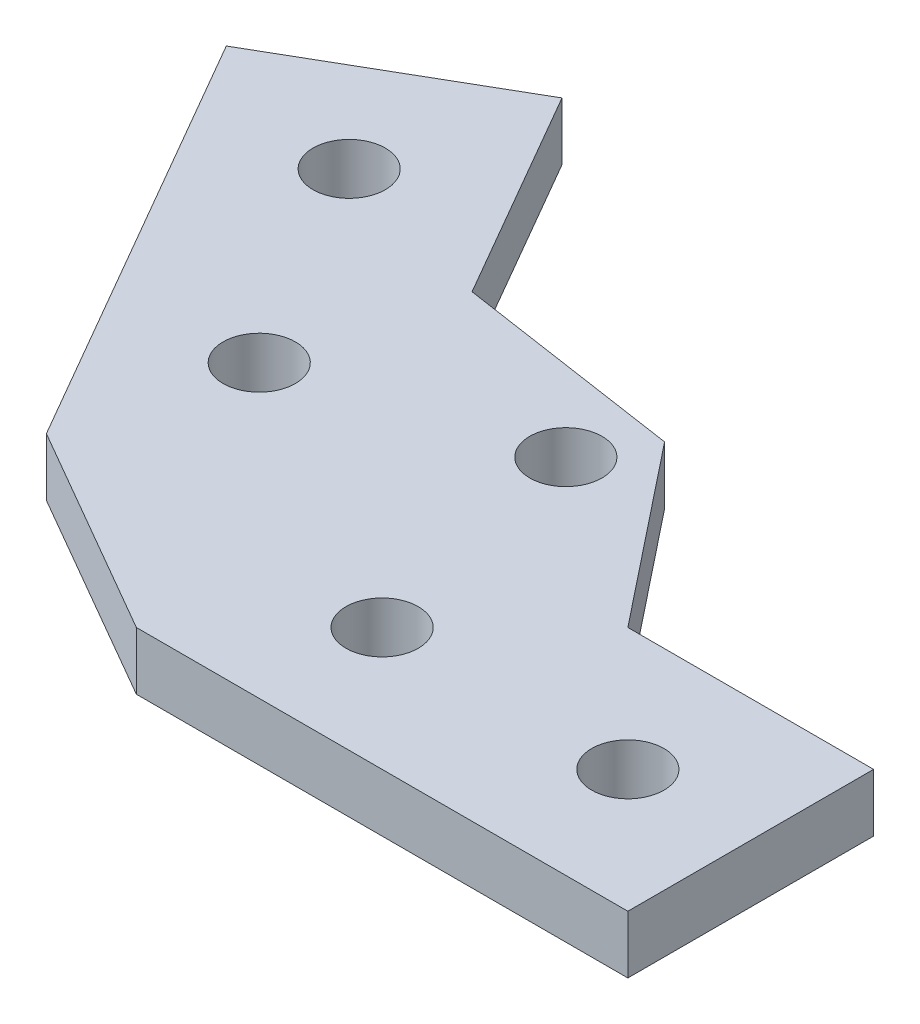
ISO-10303-21;
HEADER;
FILE_DESCRIPTION(('STEP AP214'),'2;1');
FILE_NAME('part.step','',(''),(''),'','','');
FILE_SCHEMA(('AUTOMOTIVE_DESIGN { 1 0 10303 214 1 1 1 1 }'));
ENDSEC;
DATA;
#1=APPLICATION_CONTEXT('core data for automotive mechanical design processes');
#2=APPLICATION_PROTOCOL_DEFINITION('international standard','automotive_design',2000,#1);
#3=PRODUCT_CONTEXT('',#1,'mechanical');
#4=PRODUCT('Part','Part','',(#3));
#5=PRODUCT_RELATED_PRODUCT_CATEGORY('part','',(#4));
#6=PRODUCT_DEFINITION_FORMATION('','',#4);
#7=PRODUCT_DEFINITION_CONTEXT('part definition',#1,'design');
#8=PRODUCT_DEFINITION('design','',#6,#7);
#9=PRODUCT_DEFINITION_SHAPE('','',#8);
#10=(LENGTH_UNIT() NAMED_UNIT(*) SI_UNIT(.MILLI.,.METRE.));
#11=(NAMED_UNIT(*) PLANE_ANGLE_UNIT() SI_UNIT($,.RADIAN.));
#12=(NAMED_UNIT(*) SI_UNIT($,.STERADIAN.) SOLID_ANGLE_UNIT());
#13=UNCERTAINTY_MEASURE_WITH_UNIT(LENGTH_MEASURE(1.E-05),#10,'distance_accuracy_value','');
#14=(GEOMETRIC_REPRESENTATION_CONTEXT(3) GLOBAL_UNCERTAINTY_ASSIGNED_CONTEXT((#13)) GLOBAL_UNIT_ASSIGNED_CONTEXT((#10,
#11,#12)) REPRESENTATION_CONTEXT('',''));
#15=CARTESIAN_POINT('',(0.,0.,0.));
#16=DIRECTION('',(0.,0.,1.));
#17=DIRECTION('',(1.,0.,0.));
#18=AXIS2_PLACEMENT_3D('',#15,#16,#17);
#19=CARTESIAN_POINT('',(0.,4.,0.));
#20=DIRECTION('',(0.,0.,1.));
#21=DIRECTION('',(1.,0.,0.));
#22=AXIS2_PLACEMENT_3D('',#19,#20,#21);
#23=PLANE('',#22);
#24=DIRECTION('',(0.,-1.,0.));
#25=VECTOR('',#24,1.);
#26=CARTESIAN_POINT('',(17.,4.,0.));
#27=LINE('',#26,#25);
#28=CARTESIAN_POINT('',(17.,4.,0.));
#29=VERTEX_POINT('',#28);
#30=CARTESIAN_POINT('',(17.,0.,0.));
#31=VERTEX_POINT('',#30);
#32=EDGE_CURVE('E56',#29,#31,#27,.T.);
#33=ORIENTED_EDGE('',*,*,#32,.F.);
#34=DIRECTION('',(-1.,0.,0.));
#35=VECTOR('',#34,1.);
#36=CARTESIAN_POINT('',(0.,4.,0.));
#37=LINE('',#36,#35);
#38=CARTESIAN_POINT('',(34.,4.,0.));
#39=VERTEX_POINT('',#38);
#40=EDGE_CURVE('E121',#39,#29,#37,.T.);
#41=ORIENTED_EDGE('',*,*,#40,.F.);
#42=DIRECTION('',(0.,-1.,0.));
#43=VECTOR('',#42,1.);
#44=CARTESIAN_POINT('',(34.,4.,0.));
#45=LINE('',#44,#43);
#46=CARTESIAN_POINT('',(34.,0.,0.));
#47=VERTEX_POINT('',#46);
#48=EDGE_CURVE('E203',#39,#47,#45,.T.);
#49=ORIENTED_EDGE('',*,*,#48,.T.);
#50=DIRECTION('',(-1.,0.,0.));
#51=VECTOR('',#50,1.);
#52=CARTESIAN_POINT('',(0.,0.,0.));
#53=LINE('',#52,#51);
#54=EDGE_CURVE('E61',#47,#31,#53,.T.);
#55=ORIENTED_EDGE('',*,*,#54,.T.);
#56=EDGE_LOOP('',(#33,#41,#49,#55));
#57=FACE_BOUND('',#56,.T.);
#58=ADVANCED_FACE('F41',(#57),#23,.F.);
#59=CARTESIAN_POINT('',(0.,4.,0.));
#60=DIRECTION('',(-0.866025403784436,0.,0.500000000000005));
#61=DIRECTION('',(-0.500000000000004,0.,-0.866025403784436));
#62=AXIS2_PLACEMENT_3D('',#59,#60,#61);
#63=PLANE('',#62);
#64=DIRECTION('',(0.,-1.,0.));
#65=VECTOR('',#64,1.);
#66=CARTESIAN_POINT('',(-8.50000000000015,4.,-14.7224318643354));
#67=LINE('',#66,#65);
#68=CARTESIAN_POINT('',(-8.50000000000015,4.,-14.7224318643354));
#69=VERTEX_POINT('',#68);
#70=CARTESIAN_POINT('',(-8.50000000000004,0.,-14.7224318643354));
#71=VERTEX_POINT('',#70);
#72=EDGE_CURVE('E132',#69,#71,#67,.T.);
#73=ORIENTED_EDGE('',*,*,#72,.T.);
#74=DIRECTION('',(0.500000000000004,0.,0.866025403784436));
#75=VECTOR('',#74,1.);
#76=CARTESIAN_POINT('',(0.,0.,0.));
#77=LINE('',#76,#75);
#78=CARTESIAN_POINT('',(-17.0000000000001,0.,-29.4448637286708));
#79=VERTEX_POINT('',#78);
#80=EDGE_CURVE('E160',#79,#71,#77,.T.);
#81=ORIENTED_EDGE('',*,*,#80,.F.);
#82=DIRECTION('',(0.,-1.,0.));
#83=VECTOR('',#82,1.);
#84=CARTESIAN_POINT('',(-17.0000000000001,4.,-29.4448637286708));
#85=LINE('',#84,#83);
#86=CARTESIAN_POINT('',(-17.0000000000001,4.,-29.4448637286708));
#87=VERTEX_POINT('',#86);
#88=EDGE_CURVE('E165',#87,#79,#85,.T.);
#89=ORIENTED_EDGE('',*,*,#88,.F.);
#90=DIRECTION('',(0.500000000000004,0.,0.866025403784436));
#91=VECTOR('',#90,1.);
#92=CARTESIAN_POINT('',(0.,4.,0.));
#93=LINE('',#92,#91);
#94=EDGE_CURVE('E163',#87,#69,#93,.T.);
#95=ORIENTED_EDGE('',*,*,#94,.T.);
#96=EDGE_LOOP('',(#73,#81,#89,#95));
#97=FACE_BOUND('',#96,.T.);
#98=ADVANCED_FACE('F222',(#97),#63,.F.);
#99=CARTESIAN_POINT('',(0.,4.,0.));
#100=DIRECTION('',(0.,1.,0.));
#101=DIRECTION('',(0.,0.,1.));
#102=AXIS2_PLACEMENT_3D('',#99,#100,#101);
#103=PLANE('',#102);
#104=ORIENTED_EDGE('',*,*,#40,.T.);
#105=DIRECTION('',(-0.62222130585111,0.,-0.782841392968549));
#106=VECTOR('',#105,1.);
#107=CARTESIAN_POINT('',(7.15284724790802,4.,-12.389094852156));
#108=LINE('',#107,#106);
#109=CARTESIAN_POINT('',(7.15284724790802,4.,-12.389094852156));
#110=VERTEX_POINT('',#109);
#111=EDGE_CURVE('E113',#29,#110,#108,.T.);
#112=ORIENTED_EDGE('',*,*,#111,.T.);
#113=DIRECTION('',(-0.989071186370317,0.,-0.147438761158706));
#114=VECTOR('',#113,1.);
#115=CARTESIAN_POINT('',(7.15284724790802,4.,-12.389094852156));
#116=LINE('',#115,#114);
#117=EDGE_CURVE('E119',#110,#69,#116,.T.);
#118=ORIENTED_EDGE('',*,*,#117,.T.);
#119=ORIENTED_EDGE('',*,*,#94,.F.);
#120=DIRECTION('',(0.866025403784436,0.,-0.500000000000005));
#121=VECTOR('',#120,1.);
#122=CARTESIAN_POINT('',(-17.0000000000001,4.,-29.4448637286708));
#123=LINE('',#122,#121);
#124=CARTESIAN_POINT('',(-31.7224318643356,4.,-20.9448637286708));
#125=VERTEX_POINT('',#124);
#126=EDGE_CURVE('E159',#125,#87,#123,.T.);
#127=ORIENTED_EDGE('',*,*,#126,.F.);
#128=DIRECTION('',(-0.500000000000004,0.,-0.866025403784436));
#129=VECTOR('',#128,1.);
#130=CARTESIAN_POINT('',(-14.7224318643354,4.,8.50000000000008));
#131=LINE('',#130,#129);
#132=CARTESIAN_POINT('',(-14.7224318643354,4.,8.50000000000008));
#133=VERTEX_POINT('',#132);
#134=EDGE_CURVE('E156',#133,#125,#131,.T.);
#135=ORIENTED_EDGE('',*,*,#134,.F.);
#136=DIRECTION('',(0.86602540378444,0.,0.499999999999998));
#137=VECTOR('',#136,1.);
#138=CARTESIAN_POINT('',(-14.7224318643354,4.,8.50000000000008));
#139=LINE('',#138,#137);
#140=CARTESIAN_POINT('',(0.,4.,17.));
#141=VERTEX_POINT('',#140);
#142=EDGE_CURVE('E177',#133,#141,#139,.T.);
#143=ORIENTED_EDGE('',*,*,#142,.T.);
#144=DIRECTION('',(1.,0.,0.));
#145=VECTOR('',#144,1.);
#146=CARTESIAN_POINT('',(0.,4.,17.));
#147=LINE('',#146,#145);
#148=CARTESIAN_POINT('',(34.,4.,17.));
#149=VERTEX_POINT('',#148);
#150=EDGE_CURVE('E198',#141,#149,#147,.T.);
#151=ORIENTED_EDGE('',*,*,#150,.T.);
#152=DIRECTION('',(0.,0.,-1.));
#153=VECTOR('',#152,1.);
#154=CARTESIAN_POINT('',(34.,4.,0.));
#155=LINE('',#154,#153);
#156=EDGE_CURVE('E200',#149,#39,#155,.T.);
#157=ORIENTED_EDGE('',*,*,#156,.T.);
#158=EDGE_LOOP('',(#104,#112,#118,#119,#127,#135,#143,#151,#157));
#159=FACE_BOUND('',#158,.T.);
#160=CARTESIAN_POINT('',(8.5,4.,8.5));
#161=DIRECTION('',(0.,1.,0.));
#162=DIRECTION('',(0.,0.,1.));
#163=AXIS2_PLACEMENT_3D('',#160,#161,#162);
#164=CIRCLE('',#163,2.5);
#165=CARTESIAN_POINT('',(8.5,4.,11.));
#166=VERTEX_POINT('',#165);
#167=EDGE_CURVE('E192',#166,#166,#164,.T.);
#168=ORIENTED_EDGE('',*,*,#167,.F.);
#169=EDGE_LOOP('',(#168));
#170=FACE_BOUND('',#169,.T.);
#171=CARTESIAN_POINT('',(25.5,4.,8.5));
#172=DIRECTION('',(0.,1.,0.));
#173=DIRECTION('',(0.,0.,1.));
#174=AXIS2_PLACEMENT_3D('',#171,#172,#173);
#175=CIRCLE('',#174,2.5);
#176=CARTESIAN_POINT('',(25.5,4.,11.));
#177=VERTEX_POINT('',#176);
#178=EDGE_CURVE('E186',#177,#177,#175,.T.);
#179=ORIENTED_EDGE('',*,*,#178,.F.);
#180=EDGE_LOOP('',(#179));
#181=FACE_BOUND('',#180,.T.);
#182=CARTESIAN_POINT('',(-11.6112159321677,4.,-3.11121593216767));
#183=DIRECTION('',(0.,-1.,0.));
#184=DIRECTION('',(-0.866025403784436,0.,0.500000000000005));
#185=AXIS2_PLACEMENT_3D('',#182,#183,#184);
#186=CIRCLE('',#185,2.5);
#187=CARTESIAN_POINT('',(-13.7762794416288,4.,-1.86121593216766));
#188=VERTEX_POINT('',#187);
#189=EDGE_CURVE('E150',#188,#188,#186,.T.);
#190=ORIENTED_EDGE('',*,*,#189,.T.);
#191=EDGE_LOOP('',(#190));
#192=FACE_BOUND('',#191,.T.);
#193=CARTESIAN_POINT('',(-20.1112159321678,4.,-17.8336477965031));
#194=DIRECTION('',(0.,-1.,0.));
#195=DIRECTION('',(-0.866025403784436,0.,0.500000000000005));
#196=AXIS2_PLACEMENT_3D('',#193,#194,#195);
#197=CIRCLE('',#196,2.5);
#198=CARTESIAN_POINT('',(-22.2762794416289,4.,-16.5836477965031));
#199=VERTEX_POINT('',#198);
#200=EDGE_CURVE('E144',#199,#199,#197,.T.);
#201=ORIENTED_EDGE('',*,*,#200,.T.);
#202=EDGE_LOOP('',(#201));
#203=FACE_BOUND('',#202,.T.);
#204=CARTESIAN_POINT('',(4.65284724790803,4.,-8.05896783323379));
#205=DIRECTION('',(0.,1.,0.));
#206=DIRECTION('',(0.,0.,1.));
#207=AXIS2_PLACEMENT_3D('',#204,#205,#206);
#208=CIRCLE('',#207,2.5);
#209=CARTESIAN_POINT('',(4.65284724790803,4.,-5.55896783323379));
#210=VERTEX_POINT('',#209);
#211=EDGE_CURVE('E140',#210,#210,#208,.T.);
#212=ORIENTED_EDGE('',*,*,#211,.F.);
#213=EDGE_LOOP('',(#212));
#214=FACE_BOUND('',#213,.T.);
#215=ADVANCED_FACE('F115',(#159,#170,#181,#192,#203,#214),#103,.T.);
#216=CARTESIAN_POINT('',(0.,0.,0.));
#217=DIRECTION('',(0.,1.,0.));
#218=DIRECTION('',(0.,0.,1.));
#219=AXIS2_PLACEMENT_3D('',#216,#217,#218);
#220=PLANE('',#219);
#221=DIRECTION('',(-0.62222130585111,0.,-0.782841392968549));
#222=VECTOR('',#221,1.);
#223=CARTESIAN_POINT('',(7.15284724790802,0.,-12.389094852156));
#224=LINE('',#223,#222);
#225=CARTESIAN_POINT('',(7.15284724790802,0.,-12.389094852156));
#226=VERTEX_POINT('',#225);
#227=EDGE_CURVE('E128',#31,#226,#224,.T.);
#228=ORIENTED_EDGE('',*,*,#227,.F.);
#229=ORIENTED_EDGE('',*,*,#54,.F.);
#230=DIRECTION('',(0.,0.,-1.));
#231=VECTOR('',#230,1.);
#232=CARTESIAN_POINT('',(34.,0.,0.));
#233=LINE('',#232,#231);
#234=CARTESIAN_POINT('',(34.,0.,17.));
#235=VERTEX_POINT('',#234);
#236=EDGE_CURVE('E205',#235,#47,#233,.T.);
#237=ORIENTED_EDGE('',*,*,#236,.F.);
#238=DIRECTION('',(1.,0.,0.));
#239=VECTOR('',#238,1.);
#240=CARTESIAN_POINT('',(0.,0.,17.));
#241=LINE('',#240,#239);
#242=CARTESIAN_POINT('',(0.,0.,17.));
#243=VERTEX_POINT('',#242);
#244=EDGE_CURVE('E195',#243,#235,#241,.T.);
#245=ORIENTED_EDGE('',*,*,#244,.F.);
#246=DIRECTION('',(0.86602540378444,0.,0.499999999999998));
#247=VECTOR('',#246,1.);
#248=CARTESIAN_POINT('',(-14.7224318643354,0.,8.50000000000008));
#249=LINE('',#248,#247);
#250=CARTESIAN_POINT('',(-14.7224318643354,0.,8.50000000000008));
#251=VERTEX_POINT('',#250);
#252=EDGE_CURVE('E176',#251,#243,#249,.T.);
#253=ORIENTED_EDGE('',*,*,#252,.F.);
#254=DIRECTION('',(-0.500000000000004,0.,-0.866025403784436));
#255=VECTOR('',#254,1.);
#256=CARTESIAN_POINT('',(-14.7224318643354,0.,8.50000000000008));
#257=LINE('',#256,#255);
#258=CARTESIAN_POINT('',(-31.7224318643356,0.,-20.9448637286708));
#259=VERTEX_POINT('',#258);
#260=EDGE_CURVE('E153',#251,#259,#257,.T.);
#261=ORIENTED_EDGE('',*,*,#260,.T.);
#262=DIRECTION('',(0.866025403784436,0.,-0.500000000000005));
#263=VECTOR('',#262,1.);
#264=CARTESIAN_POINT('',(-17.0000000000001,0.,-29.4448637286708));
#265=LINE('',#264,#263);
#266=EDGE_CURVE('E168',#259,#79,#265,.T.);
#267=ORIENTED_EDGE('',*,*,#266,.T.);
#268=ORIENTED_EDGE('',*,*,#80,.T.);
#269=DIRECTION('',(-0.989071186370317,0.,-0.147438761158706));
#270=VECTOR('',#269,1.);
#271=CARTESIAN_POINT('',(7.15284724790802,0.,-12.389094852156));
#272=LINE('',#271,#270);
#273=EDGE_CURVE('E123',#226,#71,#272,.T.);
#274=ORIENTED_EDGE('',*,*,#273,.F.);
#275=EDGE_LOOP('',(#228,#229,#237,#245,#253,#261,#267,#268,#274));
#276=FACE_BOUND('',#275,.T.);
#277=CARTESIAN_POINT('',(8.5,0.,8.5));
#278=DIRECTION('',(0.,1.,0.));
#279=DIRECTION('',(0.,0.,1.));
#280=AXIS2_PLACEMENT_3D('',#277,#278,#279);
#281=CIRCLE('',#280,2.5);
#282=CARTESIAN_POINT('',(8.5,0.,11.));
#283=VERTEX_POINT('',#282);
#284=EDGE_CURVE('E189',#283,#283,#281,.T.);
#285=ORIENTED_EDGE('',*,*,#284,.T.);
#286=EDGE_LOOP('',(#285));
#287=FACE_BOUND('',#286,.T.);
#288=CARTESIAN_POINT('',(25.5,0.,8.5));
#289=DIRECTION('',(0.,1.,0.));
#290=DIRECTION('',(0.,0.,1.));
#291=AXIS2_PLACEMENT_3D('',#288,#289,#290);
#292=CIRCLE('',#291,2.5);
#293=CARTESIAN_POINT('',(25.5,0.,11.));
#294=VERTEX_POINT('',#293);
#295=EDGE_CURVE('E185',#294,#294,#292,.T.);
#296=ORIENTED_EDGE('',*,*,#295,.T.);
#297=EDGE_LOOP('',(#296));
#298=FACE_BOUND('',#297,.T.);
#299=CARTESIAN_POINT('',(-11.6112159321677,0.,-3.11121593216767));
#300=DIRECTION('',(0.,-1.,0.));
#301=DIRECTION('',(-0.866025403784436,0.,0.500000000000005));
#302=AXIS2_PLACEMENT_3D('',#299,#300,#301);
#303=CIRCLE('',#302,2.5);
#304=CARTESIAN_POINT('',(-13.7762794416288,0.,-1.86121593216766));
#305=VERTEX_POINT('',#304);
#306=EDGE_CURVE('E147',#305,#305,#303,.T.);
#307=ORIENTED_EDGE('',*,*,#306,.F.);
#308=EDGE_LOOP('',(#307));
#309=FACE_BOUND('',#308,.T.);
#310=CARTESIAN_POINT('',(-20.1112159321678,0.,-17.8336477965031));
#311=DIRECTION('',(0.,-1.,0.));
#312=DIRECTION('',(-0.866025403784436,0.,0.500000000000005));
#313=AXIS2_PLACEMENT_3D('',#310,#311,#312);
#314=CIRCLE('',#313,2.5);
#315=CARTESIAN_POINT('',(-22.2762794416289,0.,-16.5836477965031));
#316=VERTEX_POINT('',#315);
#317=EDGE_CURVE('E143',#316,#316,#314,.T.);
#318=ORIENTED_EDGE('',*,*,#317,.F.);
#319=EDGE_LOOP('',(#318));
#320=FACE_BOUND('',#319,.T.);
#321=CARTESIAN_POINT('',(4.65284724790803,0.,-8.05896783323379));
#322=DIRECTION('',(0.,1.,0.));
#323=DIRECTION('',(0.,0.,1.));
#324=AXIS2_PLACEMENT_3D('',#321,#322,#323);
#325=CIRCLE('',#324,2.5);
#326=CARTESIAN_POINT('',(4.65284724790803,0.,-5.55896783323379));
#327=VERTEX_POINT('',#326);
#328=EDGE_CURVE('E285',#327,#327,#325,.T.);
#329=ORIENTED_EDGE('',*,*,#328,.T.);
#330=EDGE_LOOP('',(#329));
#331=FACE_BOUND('',#330,.T.);
#332=ADVANCED_FACE('F217',(#276,#287,#298,#309,#320,#331),#220,.F.);
#333=CARTESIAN_POINT('',(0.,4.,17.));
#334=DIRECTION('',(0.,0.,-1.));
#335=DIRECTION('',(-1.,0.,0.));
#336=AXIS2_PLACEMENT_3D('',#333,#334,#335);
#337=PLANE('',#336);
#338=ORIENTED_EDGE('',*,*,#244,.T.);
#339=DIRECTION('',(0.,-1.,0.));
#340=VECTOR('',#339,1.);
#341=CARTESIAN_POINT('',(34.,4.,17.));
#342=LINE('',#341,#340);
#343=EDGE_CURVE('E49',#149,#235,#342,.T.);
#344=ORIENTED_EDGE('',*,*,#343,.F.);
#345=ORIENTED_EDGE('',*,*,#150,.F.);
#346=DIRECTION('',(0.,-1.,0.));
#347=VECTOR('',#346,1.);
#348=CARTESIAN_POINT('',(0.,4.,17.));
#349=LINE('',#348,#347);
#350=EDGE_CURVE('E11',#141,#243,#349,.T.);
#351=ORIENTED_EDGE('',*,*,#350,.T.);
#352=EDGE_LOOP('',(#338,#344,#345,#351));
#353=FACE_BOUND('',#352,.T.);
#354=ADVANCED_FACE('F43',(#353),#337,.F.);
#355=CARTESIAN_POINT('',(34.,4.,0.));
#356=DIRECTION('',(-1.,0.,0.));
#357=DIRECTION('',(0.,0.,1.));
#358=AXIS2_PLACEMENT_3D('',#355,#356,#357);
#359=PLANE('',#358);
#360=ORIENTED_EDGE('',*,*,#236,.T.);
#361=ORIENTED_EDGE('',*,*,#48,.F.);
#362=ORIENTED_EDGE('',*,*,#156,.F.);
#363=ORIENTED_EDGE('',*,*,#343,.T.);
#364=EDGE_LOOP('',(#360,#361,#362,#363));
#365=FACE_BOUND('',#364,.T.);
#366=ADVANCED_FACE('F213',(#365),#359,.F.);
#367=CARTESIAN_POINT('',(8.5,4.,8.5));
#368=DIRECTION('',(0.,-1.,0.));
#369=DIRECTION('',(0.,0.,-1.));
#370=AXIS2_PLACEMENT_3D('',#367,#368,#369);
#371=CYLINDRICAL_SURFACE('',#370,2.5);
#372=ORIENTED_EDGE('',*,*,#167,.T.);
#373=EDGE_LOOP('',(#372));
#374=FACE_BOUND('',#373,.T.);
#375=ORIENTED_EDGE('',*,*,#284,.F.);
#376=EDGE_LOOP('',(#375));
#377=FACE_BOUND('',#376,.T.);
#378=ADVANCED_FACE('F240',(#374,#377),#371,.F.);
#379=CARTESIAN_POINT('',(25.5,4.,8.5));
#380=DIRECTION('',(0.,-1.,0.));
#381=DIRECTION('',(0.,0.,-1.));
#382=AXIS2_PLACEMENT_3D('',#379,#380,#381);
#383=CYLINDRICAL_SURFACE('',#382,2.5);
#384=ORIENTED_EDGE('',*,*,#178,.T.);
#385=EDGE_LOOP('',(#384));
#386=FACE_BOUND('',#385,.T.);
#387=ORIENTED_EDGE('',*,*,#295,.F.);
#388=EDGE_LOOP('',(#387));
#389=FACE_BOUND('',#388,.T.);
#390=ADVANCED_FACE('F255',(#386,#389),#383,.F.);
#391=CARTESIAN_POINT('',(-14.7224318643354,4.,8.50000000000008));
#392=DIRECTION('',(0.499999999999998,0.,-0.86602540378444));
#393=DIRECTION('',(-0.86602540378444,0.,-0.499999999999998));
#394=AXIS2_PLACEMENT_3D('',#391,#392,#393);
#395=PLANE('',#394);
#396=ORIENTED_EDGE('',*,*,#252,.T.);
#397=ORIENTED_EDGE('',*,*,#350,.F.);
#398=ORIENTED_EDGE('',*,*,#142,.F.);
#399=DIRECTION('',(0.,-1.,0.));
#400=VECTOR('',#399,1.);
#401=CARTESIAN_POINT('',(-14.7224318643354,4.,8.50000000000008));
#402=LINE('',#401,#400);
#403=EDGE_CURVE('E180',#133,#251,#402,.T.);
#404=ORIENTED_EDGE('',*,*,#403,.T.);
#405=EDGE_LOOP('',(#396,#397,#398,#404));
#406=FACE_BOUND('',#405,.T.);
#407=ADVANCED_FACE('F232',(#406),#395,.F.);
#408=CARTESIAN_POINT('',(-14.7224318643354,4.,8.50000000000008));
#409=DIRECTION('',(0.866025403784436,0.,-0.500000000000005));
#410=DIRECTION('',(0.500000000000004,0.,0.866025403784436));
#411=AXIS2_PLACEMENT_3D('',#408,#409,#410);
#412=PLANE('',#411);
#413=ORIENTED_EDGE('',*,*,#260,.F.);
#414=ORIENTED_EDGE('',*,*,#403,.F.);
#415=ORIENTED_EDGE('',*,*,#134,.T.);
#416=DIRECTION('',(0.,-1.,0.));
#417=VECTOR('',#416,1.);
#418=CARTESIAN_POINT('',(-31.7224318643356,4.,-20.9448637286708));
#419=LINE('',#418,#417);
#420=EDGE_CURVE('E174',#125,#259,#419,.T.);
#421=ORIENTED_EDGE('',*,*,#420,.T.);
#422=EDGE_LOOP('',(#413,#414,#415,#421));
#423=FACE_BOUND('',#422,.T.);
#424=ADVANCED_FACE('F230',(#423),#412,.F.);
#425=CARTESIAN_POINT('',(-17.0000000000001,4.,-29.4448637286708));
#426=DIRECTION('',(0.500000000000004,0.,0.866025403784436));
#427=DIRECTION('',(-0.866025403784436,0.,0.500000000000005));
#428=AXIS2_PLACEMENT_3D('',#425,#426,#427);
#429=PLANE('',#428);
#430=ORIENTED_EDGE('',*,*,#266,.F.);
#431=ORIENTED_EDGE('',*,*,#420,.F.);
#432=ORIENTED_EDGE('',*,*,#126,.T.);
#433=ORIENTED_EDGE('',*,*,#88,.T.);
#434=EDGE_LOOP('',(#430,#431,#432,#433));
#435=FACE_BOUND('',#434,.T.);
#436=ADVANCED_FACE('F226',(#435),#429,.F.);
#437=CARTESIAN_POINT('',(-11.6112159321677,4.,-3.11121593216767));
#438=DIRECTION('',(0.,-1.,0.));
#439=DIRECTION('',(0.866025403784436,0.,-0.500000000000005));
#440=AXIS2_PLACEMENT_3D('',#437,#438,#439);
#441=CYLINDRICAL_SURFACE('',#440,2.5);
#442=ORIENTED_EDGE('',*,*,#189,.F.);
#443=EDGE_LOOP('',(#442));
#444=FACE_BOUND('',#443,.T.);
#445=ORIENTED_EDGE('',*,*,#306,.T.);
#446=EDGE_LOOP('',(#445));
#447=FACE_BOUND('',#446,.T.);
#448=ADVANCED_FACE('F263',(#444,#447),#441,.F.);
#449=CARTESIAN_POINT('',(-20.1112159321678,4.,-17.8336477965031));
#450=DIRECTION('',(0.,-1.,0.));
#451=DIRECTION('',(0.866025403784436,0.,-0.500000000000005));
#452=AXIS2_PLACEMENT_3D('',#449,#450,#451);
#453=CYLINDRICAL_SURFACE('',#452,2.5);
#454=ORIENTED_EDGE('',*,*,#200,.F.);
#455=EDGE_LOOP('',(#454));
#456=FACE_BOUND('',#455,.T.);
#457=ORIENTED_EDGE('',*,*,#317,.T.);
#458=EDGE_LOOP('',(#457));
#459=FACE_BOUND('',#458,.T.);
#460=ADVANCED_FACE('F267',(#456,#459),#453,.F.);
#461=CARTESIAN_POINT('',(7.15284724790802,4.,-12.389094852156));
#462=DIRECTION('',(-0.782841392968549,0.,0.622221305851111));
#463=DIRECTION('',(0.622221305851111,0.,0.782841392968549));
#464=AXIS2_PLACEMENT_3D('',#461,#462,#463);
#465=PLANE('',#464);
#466=ORIENTED_EDGE('',*,*,#227,.T.);
#467=DIRECTION('',(0.,-1.,0.));
#468=VECTOR('',#467,1.);
#469=CARTESIAN_POINT('',(7.15284724790802,4.,-12.389094852156));
#470=LINE('',#469,#468);
#471=EDGE_CURVE('E126',#110,#226,#470,.T.);
#472=ORIENTED_EDGE('',*,*,#471,.F.);
#473=ORIENTED_EDGE('',*,*,#111,.F.);
#474=ORIENTED_EDGE('',*,*,#32,.T.);
#475=EDGE_LOOP('',(#466,#472,#473,#474));
#476=FACE_BOUND('',#475,.T.);
#477=ADVANCED_FACE('F127',(#476),#465,.F.);
#478=CARTESIAN_POINT('',(7.15284724790802,4.,-12.389094852156));
#479=DIRECTION('',(-0.147438761158706,0.,0.989071186370317));
#480=DIRECTION('',(0.989071186370317,0.,0.147438761158706));
#481=AXIS2_PLACEMENT_3D('',#478,#479,#480);
#482=PLANE('',#481);
#483=ORIENTED_EDGE('',*,*,#273,.T.);
#484=ORIENTED_EDGE('',*,*,#72,.F.);
#485=ORIENTED_EDGE('',*,*,#117,.F.);
#486=ORIENTED_EDGE('',*,*,#471,.T.);
#487=EDGE_LOOP('',(#483,#484,#485,#486));
#488=FACE_BOUND('',#487,.T.);
#489=ADVANCED_FACE('F134',(#488),#482,.F.);
#490=CARTESIAN_POINT('',(4.65284724790803,4.,-8.05896783323379));
#491=DIRECTION('',(0.,-1.,0.));
#492=DIRECTION('',(0.,0.,-1.));
#493=AXIS2_PLACEMENT_3D('',#490,#491,#492);
#494=CYLINDRICAL_SURFACE('',#493,2.5);
#495=ORIENTED_EDGE('',*,*,#211,.T.);
#496=EDGE_LOOP('',(#495));
#497=FACE_BOUND('',#496,.T.);
#498=ORIENTED_EDGE('',*,*,#328,.F.);
#499=EDGE_LOOP('',(#498));
#500=FACE_BOUND('',#499,.T.);
#501=ADVANCED_FACE('F275',(#497,#500),#494,.F.);
#502=CLOSED_SHELL('',(#58,#98,#215,#332,#354,#366,#378,#390,#407,#424,#436,#448,#460,#477,#489,#501));
#503=MANIFOLD_SOLID_BREP('B2',#502);
#504=ADVANCED_BREP_SHAPE_REPRESENTATION('',(#18,#503),#14);
#505=SHAPE_DEFINITION_REPRESENTATION(#9,#504);
ENDSEC;
END-ISO-10303-21;
